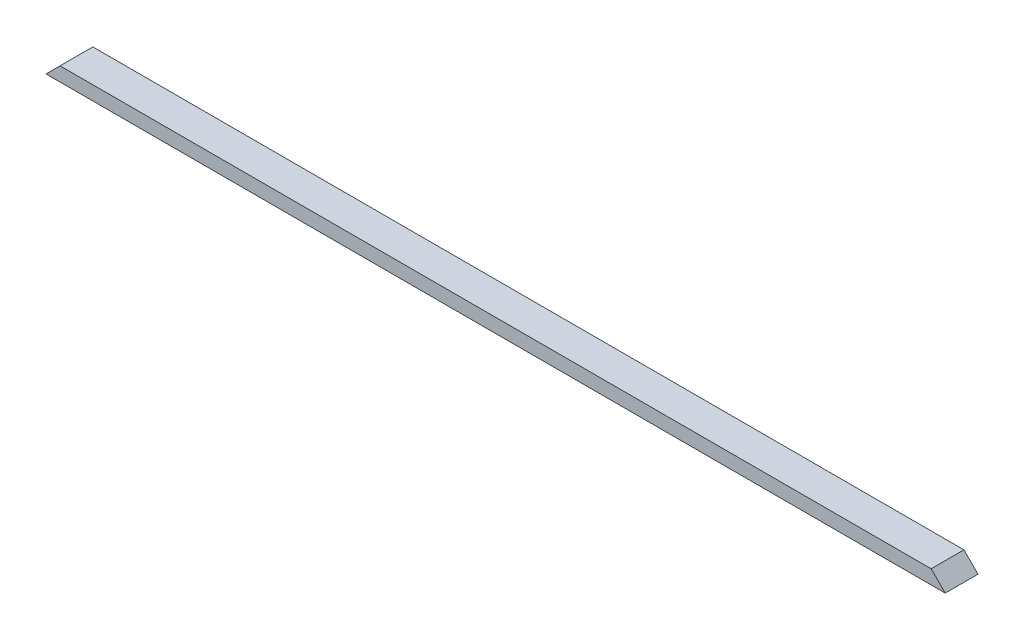
ISO-10303-21;
HEADER;
FILE_DESCRIPTION(('STEP AP214'),'2;1');
FILE_NAME('part.step','',(''),(''),'','','');
FILE_SCHEMA(('AUTOMOTIVE_DESIGN { 1 0 10303 214 1 1 1 1 }'));
ENDSEC;
DATA;
#1=APPLICATION_CONTEXT('core data for automotive mechanical design processes');
#2=APPLICATION_PROTOCOL_DEFINITION('international standard','automotive_design',2000,#1);
#3=PRODUCT_CONTEXT('',#1,'mechanical');
#4=PRODUCT('Part','Part','',(#3));
#5=PRODUCT_RELATED_PRODUCT_CATEGORY('part','',(#4));
#6=PRODUCT_DEFINITION_FORMATION('','',#4);
#7=PRODUCT_DEFINITION_CONTEXT('part definition',#1,'design');
#8=PRODUCT_DEFINITION('design','',#6,#7);
#9=PRODUCT_DEFINITION_SHAPE('','',#8);
#10=(LENGTH_UNIT() NAMED_UNIT(*) SI_UNIT(.MILLI.,.METRE.));
#11=(NAMED_UNIT(*) PLANE_ANGLE_UNIT() SI_UNIT($,.RADIAN.));
#12=(NAMED_UNIT(*) SI_UNIT($,.STERADIAN.) SOLID_ANGLE_UNIT());
#13=UNCERTAINTY_MEASURE_WITH_UNIT(LENGTH_MEASURE(1.E-05),#10,'distance_accuracy_value','');
#14=(GEOMETRIC_REPRESENTATION_CONTEXT(3) GLOBAL_UNCERTAINTY_ASSIGNED_CONTEXT((#13)) GLOBAL_UNIT_ASSIGNED_CONTEXT((#10,
#11,#12)) REPRESENTATION_CONTEXT('',''));
#15=CARTESIAN_POINT('',(0.,0.,0.));
#16=DIRECTION('',(0.,0.,1.));
#17=DIRECTION('',(1.,0.,0.));
#18=AXIS2_PLACEMENT_3D('',#15,#16,#17);
#19=CARTESIAN_POINT('',(0.,38.1,0.));
#20=DIRECTION('',(0.,0.,-1.));
#21=DIRECTION('',(-1.,0.,0.));
#22=AXIS2_PLACEMENT_3D('',#19,#20,#21);
#23=PLANE('',#22);
#24=DIRECTION('',(1.,0.,0.));
#25=VECTOR('',#24,1.);
#26=CARTESIAN_POINT('',(0.,38.1,0.));
#27=LINE('',#26,#25);
#28=CARTESIAN_POINT('',(38.1,38.1,0.));
#29=VERTEX_POINT('',#28);
#30=CARTESIAN_POINT('',(2400.3,38.1000000000001,0.));
#31=VERTEX_POINT('',#30);
#32=EDGE_CURVE('E47',#29,#31,#27,.T.);
#33=ORIENTED_EDGE('',*,*,#32,.F.);
#34=DIRECTION('',(0.707106781186547,0.707106781186547,0.));
#35=VECTOR('',#34,1.);
#36=CARTESIAN_POINT('',(0.,0.,0.));
#37=LINE('',#36,#35);
#38=CARTESIAN_POINT('',(0.,0.,0.));
#39=VERTEX_POINT('',#38);
#40=EDGE_CURVE('E82',#39,#29,#37,.T.);
#41=ORIENTED_EDGE('',*,*,#40,.F.);
#42=DIRECTION('',(1.,0.,0.));
#43=VECTOR('',#42,1.);
#44=CARTESIAN_POINT('',(0.,0.,0.));
#45=LINE('',#44,#43);
#46=CARTESIAN_POINT('',(2438.4,0.,0.));
#47=VERTEX_POINT('',#46);
#48=EDGE_CURVE('E87',#39,#47,#45,.T.);
#49=ORIENTED_EDGE('',*,*,#48,.T.);
#50=DIRECTION('',(0.707106781186547,-0.707106781186548,0.));
#51=VECTOR('',#50,1.);
#52=CARTESIAN_POINT('',(2400.3,38.1000000000001,0.));
#53=LINE('',#52,#51);
#54=EDGE_CURVE('E63',#31,#47,#53,.T.);
#55=ORIENTED_EDGE('',*,*,#54,.F.);
#56=EDGE_LOOP('',(#33,#41,#49,#55));
#57=FACE_BOUND('',#56,.T.);
#58=ADVANCED_FACE('F39',(#57),#23,.F.);
#59=CARTESIAN_POINT('',(0.,38.1,-88.9));
#60=DIRECTION('',(0.,0.,1.));
#61=DIRECTION('',(1.,0.,0.));
#62=AXIS2_PLACEMENT_3D('',#59,#60,#61);
#63=PLANE('',#62);
#64=DIRECTION('',(-1.,0.,0.));
#65=VECTOR('',#64,1.);
#66=CARTESIAN_POINT('',(0.,0.,-88.9));
#67=LINE('',#66,#65);
#68=CARTESIAN_POINT('',(2438.4,0.,-88.9));
#69=VERTEX_POINT('',#68);
#70=CARTESIAN_POINT('',(0.,0.,-88.9));
#71=VERTEX_POINT('',#70);
#72=EDGE_CURVE('E42',#69,#71,#67,.T.);
#73=ORIENTED_EDGE('',*,*,#72,.T.);
#74=DIRECTION('',(0.707106781186547,0.707106781186547,0.));
#75=VECTOR('',#74,1.);
#76=CARTESIAN_POINT('',(0.,0.,-88.9));
#77=LINE('',#76,#75);
#78=CARTESIAN_POINT('',(38.1,38.1,-88.9));
#79=VERTEX_POINT('',#78);
#80=EDGE_CURVE('E55',#71,#79,#77,.T.);
#81=ORIENTED_EDGE('',*,*,#80,.T.);
#82=DIRECTION('',(-1.,0.,0.));
#83=VECTOR('',#82,1.);
#84=CARTESIAN_POINT('',(0.,38.1,-88.9));
#85=LINE('',#84,#83);
#86=CARTESIAN_POINT('',(2400.3,38.1000000000001,-88.9));
#87=VERTEX_POINT('',#86);
#88=EDGE_CURVE('E11',#87,#79,#85,.T.);
#89=ORIENTED_EDGE('',*,*,#88,.F.);
#90=DIRECTION('',(0.707106781186547,-0.707106781186548,0.));
#91=VECTOR('',#90,1.);
#92=CARTESIAN_POINT('',(2400.3,38.1000000000001,-88.9));
#93=LINE('',#92,#91);
#94=EDGE_CURVE('E100',#87,#69,#93,.T.);
#95=ORIENTED_EDGE('',*,*,#94,.T.);
#96=EDGE_LOOP('',(#73,#81,#89,#95));
#97=FACE_BOUND('',#96,.T.);
#98=ADVANCED_FACE('F109',(#97),#63,.F.);
#99=CARTESIAN_POINT('',(0.,38.1,0.));
#100=DIRECTION('',(0.,-1.,0.));
#101=DIRECTION('',(0.,0.,-1.));
#102=AXIS2_PLACEMENT_3D('',#99,#100,#101);
#103=PLANE('',#102);
#104=ORIENTED_EDGE('',*,*,#88,.T.);
#105=DIRECTION('',(0.,0.,1.));
#106=VECTOR('',#105,1.);
#107=CARTESIAN_POINT('',(38.1,38.1,-88.9));
#108=LINE('',#107,#106);
#109=EDGE_CURVE('E88',#79,#29,#108,.T.);
#110=ORIENTED_EDGE('',*,*,#109,.T.);
#111=ORIENTED_EDGE('',*,*,#32,.T.);
#112=DIRECTION('',(0.,0.,1.));
#113=VECTOR('',#112,1.);
#114=CARTESIAN_POINT('',(2400.3,38.1000000000001,-88.9));
#115=LINE('',#114,#113);
#116=EDGE_CURVE('E103',#87,#31,#115,.T.);
#117=ORIENTED_EDGE('',*,*,#116,.F.);
#118=EDGE_LOOP('',(#104,#110,#111,#117));
#119=FACE_BOUND('',#118,.T.);
#120=ADVANCED_FACE('F112',(#119),#103,.F.);
#121=CARTESIAN_POINT('',(0.,0.,0.));
#122=DIRECTION('',(0.,-1.,0.));
#123=DIRECTION('',(0.,0.,-1.));
#124=AXIS2_PLACEMENT_3D('',#121,#122,#123);
#125=PLANE('',#124);
#126=DIRECTION('',(0.,0.,1.));
#127=VECTOR('',#126,1.);
#128=CARTESIAN_POINT('',(0.,0.,0.));
#129=LINE('',#128,#127);
#130=EDGE_CURVE('E79',#71,#39,#129,.T.);
#131=ORIENTED_EDGE('',*,*,#130,.F.);
#132=ORIENTED_EDGE('',*,*,#72,.F.);
#133=DIRECTION('',(0.,0.,-1.));
#134=VECTOR('',#133,1.);
#135=CARTESIAN_POINT('',(2438.4,0.,0.));
#136=LINE('',#135,#134);
#137=EDGE_CURVE('E96',#47,#69,#136,.T.);
#138=ORIENTED_EDGE('',*,*,#137,.F.);
#139=ORIENTED_EDGE('',*,*,#48,.F.);
#140=EDGE_LOOP('',(#131,#132,#138,#139));
#141=FACE_BOUND('',#140,.T.);
#142=ADVANCED_FACE('F95',(#141),#125,.T.);
#143=CARTESIAN_POINT('',(2400.3,38.1000000000001,-88.9));
#144=DIRECTION('',(-0.707106781186548,-0.707106781186547,0.));
#145=DIRECTION('',(0.707106781186547,-0.707106781186548,0.));
#146=AXIS2_PLACEMENT_3D('',#143,#144,#145);
#147=PLANE('',#146);
#148=ORIENTED_EDGE('',*,*,#54,.T.);
#149=ORIENTED_EDGE('',*,*,#137,.T.);
#150=ORIENTED_EDGE('',*,*,#94,.F.);
#151=ORIENTED_EDGE('',*,*,#116,.T.);
#152=EDGE_LOOP('',(#148,#149,#150,#151));
#153=FACE_BOUND('',#152,.T.);
#154=ADVANCED_FACE('F113',(#153),#147,.F.);
#155=CARTESIAN_POINT('',(0.,0.,-88.9));
#156=DIRECTION('',(0.707106781186547,-0.707106781186547,0.));
#157=DIRECTION('',(0.707106781186548,0.707106781186548,0.));
#158=AXIS2_PLACEMENT_3D('',#155,#156,#157);
#159=PLANE('',#158);
#160=ORIENTED_EDGE('',*,*,#40,.T.);
#161=ORIENTED_EDGE('',*,*,#109,.F.);
#162=ORIENTED_EDGE('',*,*,#80,.F.);
#163=ORIENTED_EDGE('',*,*,#130,.T.);
#164=EDGE_LOOP('',(#160,#161,#162,#163));
#165=FACE_BOUND('',#164,.T.);
#166=ADVANCED_FACE('F81',(#165),#159,.F.);
#167=CLOSED_SHELL('',(#58,#98,#120,#142,#154,#166));
#168=MANIFOLD_SOLID_BREP('B2',#167);
#169=ADVANCED_BREP_SHAPE_REPRESENTATION('',(#18,#168),#14);
#170=SHAPE_DEFINITION_REPRESENTATION(#9,#169);
ENDSEC;
END-ISO-10303-21;
